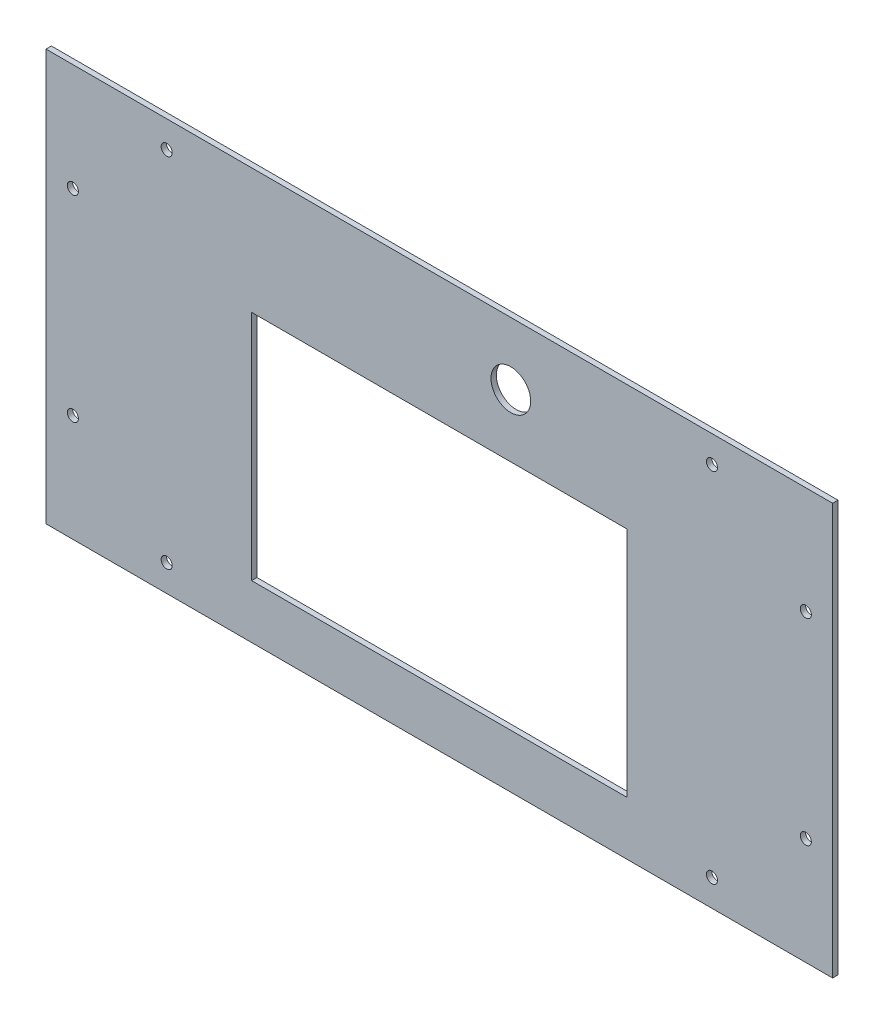
ISO-10303-21;
HEADER;
FILE_DESCRIPTION(('STEP AP214'),'2;1');
FILE_NAME('part.step','',(''),(''),'','','');
FILE_SCHEMA(('AUTOMOTIVE_DESIGN { 1 0 10303 214 1 1 1 1 }'));
ENDSEC;
DATA;
#1=APPLICATION_CONTEXT('core data for automotive mechanical design processes');
#2=APPLICATION_PROTOCOL_DEFINITION('international standard','automotive_design',2000,#1);
#3=PRODUCT_CONTEXT('',#1,'mechanical');
#4=PRODUCT('Part','Part','',(#3));
#5=PRODUCT_RELATED_PRODUCT_CATEGORY('part','',(#4));
#6=PRODUCT_DEFINITION_FORMATION('','',#4);
#7=PRODUCT_DEFINITION_CONTEXT('part definition',#1,'design');
#8=PRODUCT_DEFINITION('design','',#6,#7);
#9=PRODUCT_DEFINITION_SHAPE('','',#8);
#10=(LENGTH_UNIT() NAMED_UNIT(*) SI_UNIT(.MILLI.,.METRE.));
#11=(NAMED_UNIT(*) PLANE_ANGLE_UNIT() SI_UNIT($,.RADIAN.));
#12=(NAMED_UNIT(*) SI_UNIT($,.STERADIAN.) SOLID_ANGLE_UNIT());
#13=UNCERTAINTY_MEASURE_WITH_UNIT(LENGTH_MEASURE(1.E-05),#10,'distance_accuracy_value','');
#14=(GEOMETRIC_REPRESENTATION_CONTEXT(3) GLOBAL_UNCERTAINTY_ASSIGNED_CONTEXT((#13)) GLOBAL_UNIT_ASSIGNED_CONTEXT((#10,
#11,#12)) REPRESENTATION_CONTEXT('',''));
#15=CARTESIAN_POINT('',(0.,0.,0.));
#16=DIRECTION('',(0.,0.,1.));
#17=DIRECTION('',(1.,0.,0.));
#18=AXIS2_PLACEMENT_3D('',#15,#16,#17);
#19=CARTESIAN_POINT('',(220.,115.,3.));
#20=DIRECTION('',(-1.,0.,0.));
#21=DIRECTION('',(0.,0.,1.));
#22=AXIS2_PLACEMENT_3D('',#19,#20,#21);
#23=PLANE('',#22);
#24=DIRECTION('',(0.,1.,0.));
#25=VECTOR('',#24,1.);
#26=CARTESIAN_POINT('',(220.,115.,0.));
#27=LINE('',#26,#25);
#28=CARTESIAN_POINT('',(220.,-115.,0.));
#29=VERTEX_POINT('',#28);
#30=CARTESIAN_POINT('',(220.,115.,0.));
#31=VERTEX_POINT('',#30);
#32=EDGE_CURVE('E183',#29,#31,#27,.T.);
#33=ORIENTED_EDGE('',*,*,#32,.T.);
#34=DIRECTION('',(0.,0.,-1.));
#35=VECTOR('',#34,1.);
#36=CARTESIAN_POINT('',(220.,115.,3.));
#37=LINE('',#36,#35);
#38=CARTESIAN_POINT('',(220.,115.,3.));
#39=VERTEX_POINT('',#38);
#40=EDGE_CURVE('E11',#39,#31,#37,.T.);
#41=ORIENTED_EDGE('',*,*,#40,.F.);
#42=DIRECTION('',(0.,1.,0.));
#43=VECTOR('',#42,1.);
#44=CARTESIAN_POINT('',(220.,115.,3.));
#45=LINE('',#44,#43);
#46=CARTESIAN_POINT('',(220.,-115.,3.));
#47=VERTEX_POINT('',#46);
#48=EDGE_CURVE('E186',#47,#39,#45,.T.);
#49=ORIENTED_EDGE('',*,*,#48,.F.);
#50=DIRECTION('',(0.,0.,-1.));
#51=VECTOR('',#50,1.);
#52=CARTESIAN_POINT('',(220.,-115.,3.));
#53=LINE('',#52,#51);
#54=EDGE_CURVE('E196',#47,#29,#53,.T.);
#55=ORIENTED_EDGE('',*,*,#54,.T.);
#56=EDGE_LOOP('',(#33,#41,#49,#55));
#57=FACE_BOUND('',#56,.T.);
#58=ADVANCED_FACE('F33',(#57),#23,.F.);
#59=CARTESIAN_POINT('',(-220.,115.,3.));
#60=DIRECTION('',(0.,-1.,0.));
#61=DIRECTION('',(0.,0.,-1.));
#62=AXIS2_PLACEMENT_3D('',#59,#60,#61);
#63=PLANE('',#62);
#64=DIRECTION('',(-1.,0.,0.));
#65=VECTOR('',#64,1.);
#66=CARTESIAN_POINT('',(-220.,115.,0.));
#67=LINE('',#66,#65);
#68=CARTESIAN_POINT('',(-220.,115.,0.));
#69=VERTEX_POINT('',#68);
#70=EDGE_CURVE('E199',#31,#69,#67,.T.);
#71=ORIENTED_EDGE('',*,*,#70,.T.);
#72=DIRECTION('',(0.,0.,-1.));
#73=VECTOR('',#72,1.);
#74=CARTESIAN_POINT('',(-220.,115.,3.));
#75=LINE('',#74,#73);
#76=CARTESIAN_POINT('',(-220.,115.,3.));
#77=VERTEX_POINT('',#76);
#78=EDGE_CURVE('E40',#77,#69,#75,.T.);
#79=ORIENTED_EDGE('',*,*,#78,.F.);
#80=DIRECTION('',(-1.,0.,0.));
#81=VECTOR('',#80,1.);
#82=CARTESIAN_POINT('',(-220.,115.,3.));
#83=LINE('',#82,#81);
#84=EDGE_CURVE('E189',#39,#77,#83,.T.);
#85=ORIENTED_EDGE('',*,*,#84,.F.);
#86=ORIENTED_EDGE('',*,*,#40,.T.);
#87=EDGE_LOOP('',(#71,#79,#85,#86));
#88=FACE_BOUND('',#87,.T.);
#89=ADVANCED_FACE('F228',(#88),#63,.F.);
#90=CARTESIAN_POINT('',(-220.,115.,3.));
#91=DIRECTION('',(1.,0.,0.));
#92=DIRECTION('',(0.,1.,0.));
#93=AXIS2_PLACEMENT_3D('',#90,#91,#92);
#94=PLANE('',#93);
#95=DIRECTION('',(0.,-1.,0.));
#96=VECTOR('',#95,1.);
#97=CARTESIAN_POINT('',(-220.,115.,0.));
#98=LINE('',#97,#96);
#99=CARTESIAN_POINT('',(-220.,-115.,0.));
#100=VERTEX_POINT('',#99);
#101=EDGE_CURVE('E201',#69,#100,#98,.T.);
#102=ORIENTED_EDGE('',*,*,#101,.T.);
#103=DIRECTION('',(0.,0.,-1.));
#104=VECTOR('',#103,1.);
#105=CARTESIAN_POINT('',(-220.,-115.,3.));
#106=LINE('',#105,#104);
#107=CARTESIAN_POINT('',(-220.,-115.,3.));
#108=VERTEX_POINT('',#107);
#109=EDGE_CURVE('E206',#108,#100,#106,.T.);
#110=ORIENTED_EDGE('',*,*,#109,.F.);
#111=DIRECTION('',(0.,-1.,0.));
#112=VECTOR('',#111,1.);
#113=CARTESIAN_POINT('',(-220.,115.,3.));
#114=LINE('',#113,#112);
#115=EDGE_CURVE('E192',#77,#108,#114,.T.);
#116=ORIENTED_EDGE('',*,*,#115,.F.);
#117=ORIENTED_EDGE('',*,*,#78,.T.);
#118=EDGE_LOOP('',(#102,#110,#116,#117));
#119=FACE_BOUND('',#118,.T.);
#120=ADVANCED_FACE('F213',(#119),#94,.F.);
#121=CARTESIAN_POINT('',(-220.,-115.,3.));
#122=DIRECTION('',(0.,1.,0.));
#123=DIRECTION('',(0.,0.,1.));
#124=AXIS2_PLACEMENT_3D('',#121,#122,#123);
#125=PLANE('',#124);
#126=DIRECTION('',(1.,0.,0.));
#127=VECTOR('',#126,1.);
#128=CARTESIAN_POINT('',(-220.,-115.,0.));
#129=LINE('',#128,#127);
#130=EDGE_CURVE('E190',#100,#29,#129,.T.);
#131=ORIENTED_EDGE('',*,*,#130,.T.);
#132=ORIENTED_EDGE('',*,*,#54,.F.);
#133=DIRECTION('',(1.,0.,0.));
#134=VECTOR('',#133,1.);
#135=CARTESIAN_POINT('',(-220.,-115.,3.));
#136=LINE('',#135,#134);
#137=EDGE_CURVE('E194',#108,#47,#136,.T.);
#138=ORIENTED_EDGE('',*,*,#137,.F.);
#139=ORIENTED_EDGE('',*,*,#109,.T.);
#140=EDGE_LOOP('',(#131,#132,#138,#139));
#141=FACE_BOUND('',#140,.T.);
#142=ADVANCED_FACE('F222',(#141),#125,.F.);
#143=CARTESIAN_POINT('',(0.,0.,3.));
#144=DIRECTION('',(0.,0.,1.));
#145=DIRECTION('',(1.,0.,0.));
#146=AXIS2_PLACEMENT_3D('',#143,#144,#145);
#147=PLANE('',#146);
#148=CARTESIAN_POINT('',(40.,80.,3.));
#149=DIRECTION('',(0.,0.,-1.));
#150=DIRECTION('',(-1.,0.,0.));
#151=AXIS2_PLACEMENT_3D('',#148,#149,#150);
#152=CIRCLE('',#151,11.1);
#153=CARTESIAN_POINT('',(28.9,80.,3.));
#154=VERTEX_POINT('',#153);
#155=EDGE_CURVE('E128',#154,#154,#152,.T.);
#156=ORIENTED_EDGE('',*,*,#155,.T.);
#157=EDGE_LOOP('',(#156));
#158=FACE_BOUND('',#157,.T.);
#159=DIRECTION('',(0.,1.,0.));
#160=VECTOR('',#159,1.);
#161=CARTESIAN_POINT('',(-105.,45.,3.));
#162=LINE('',#161,#160);
#163=CARTESIAN_POINT('',(-105.,-85.,3.));
#164=VERTEX_POINT('',#163);
#165=CARTESIAN_POINT('',(-105.,45.,3.));
#166=VERTEX_POINT('',#165);
#167=EDGE_CURVE('E99',#164,#166,#162,.T.);
#168=ORIENTED_EDGE('',*,*,#167,.T.);
#169=DIRECTION('',(1.,0.,0.));
#170=VECTOR('',#169,1.);
#171=CARTESIAN_POINT('',(105.,45.,3.));
#172=LINE('',#171,#170);
#173=CARTESIAN_POINT('',(105.,45.,3.));
#174=VERTEX_POINT('',#173);
#175=EDGE_CURVE('E108',#166,#174,#172,.T.);
#176=ORIENTED_EDGE('',*,*,#175,.T.);
#177=DIRECTION('',(0.,-1.,0.));
#178=VECTOR('',#177,1.);
#179=CARTESIAN_POINT('',(105.,45.,3.));
#180=LINE('',#179,#178);
#181=CARTESIAN_POINT('',(105.,-85.,3.));
#182=VERTEX_POINT('',#181);
#183=EDGE_CURVE('E47',#174,#182,#180,.T.);
#184=ORIENTED_EDGE('',*,*,#183,.T.);
#185=DIRECTION('',(-1.,0.,0.));
#186=VECTOR('',#185,1.);
#187=CARTESIAN_POINT('',(105.,-85.,3.));
#188=LINE('',#187,#186);
#189=EDGE_CURVE('E105',#182,#164,#188,.T.);
#190=ORIENTED_EDGE('',*,*,#189,.T.);
#191=EDGE_LOOP('',(#168,#176,#184,#190));
#192=FACE_BOUND('',#191,.T.);
#193=CARTESIAN_POINT('',(-152.5,100.,3.));
#194=DIRECTION('',(0.,0.,1.));
#195=DIRECTION('',(1.,0.,0.));
#196=AXIS2_PLACEMENT_3D('',#193,#194,#195);
#197=CIRCLE('',#196,3.09999999999999);
#198=CARTESIAN_POINT('',(-149.4,100.,3.));
#199=VERTEX_POINT('',#198);
#200=EDGE_CURVE('E160',#199,#199,#197,.T.);
#201=ORIENTED_EDGE('',*,*,#200,.F.);
#202=EDGE_LOOP('',(#201));
#203=FACE_BOUND('',#202,.T.);
#204=CARTESIAN_POINT('',(152.5,100.,3.));
#205=DIRECTION('',(0.,0.,1.));
#206=DIRECTION('',(-1.,0.,0.));
#207=AXIS2_PLACEMENT_3D('',#204,#205,#206);
#208=CIRCLE('',#207,3.09999999999999);
#209=CARTESIAN_POINT('',(149.4,100.,3.));
#210=VERTEX_POINT('',#209);
#211=EDGE_CURVE('E166',#210,#210,#208,.T.);
#212=ORIENTED_EDGE('',*,*,#211,.F.);
#213=EDGE_LOOP('',(#212));
#214=FACE_BOUND('',#213,.T.);
#215=CARTESIAN_POINT('',(-205.,-55.0000000000368,3.));
#216=DIRECTION('',(0.,0.,1.));
#217=DIRECTION('',(-1.,0.,0.));
#218=AXIS2_PLACEMENT_3D('',#215,#216,#217);
#219=CIRCLE('',#218,3.09999999999999);
#220=CARTESIAN_POINT('',(-208.1,-55.0000000000368,3.));
#221=VERTEX_POINT('',#220);
#222=EDGE_CURVE('E172',#221,#221,#219,.T.);
#223=ORIENTED_EDGE('',*,*,#222,.F.);
#224=EDGE_LOOP('',(#223));
#225=FACE_BOUND('',#224,.T.);
#226=CARTESIAN_POINT('',(205.,-55.0000000000368,3.));
#227=DIRECTION('',(0.,0.,1.));
#228=DIRECTION('',(1.,0.,0.));
#229=AXIS2_PLACEMENT_3D('',#226,#227,#228);
#230=CIRCLE('',#229,3.09999999999999);
#231=CARTESIAN_POINT('',(208.1,-55.0000000000368,3.));
#232=VERTEX_POINT('',#231);
#233=EDGE_CURVE('E141',#232,#232,#230,.T.);
#234=ORIENTED_EDGE('',*,*,#233,.F.);
#235=EDGE_LOOP('',(#234));
#236=FACE_BOUND('',#235,.T.);
#237=CARTESIAN_POINT('',(205.,54.9999999999632,3.));
#238=DIRECTION('',(0.,0.,1.));
#239=DIRECTION('',(-1.,0.,0.));
#240=AXIS2_PLACEMENT_3D('',#237,#238,#239);
#241=CIRCLE('',#240,3.09999999999999);
#242=CARTESIAN_POINT('',(201.9,54.9999999999632,3.));
#243=VERTEX_POINT('',#242);
#244=EDGE_CURVE('E142',#243,#243,#241,.T.);
#245=ORIENTED_EDGE('',*,*,#244,.F.);
#246=EDGE_LOOP('',(#245));
#247=FACE_BOUND('',#246,.T.);
#248=CARTESIAN_POINT('',(152.5,-100.000000000073,3.));
#249=DIRECTION('',(0.,0.,1.));
#250=DIRECTION('',(1.,0.,0.));
#251=AXIS2_PLACEMENT_3D('',#248,#249,#250);
#252=CIRCLE('',#251,3.09999999999999);
#253=CARTESIAN_POINT('',(155.6,-100.000000000073,3.));
#254=VERTEX_POINT('',#253);
#255=EDGE_CURVE('E148',#254,#254,#252,.T.);
#256=ORIENTED_EDGE('',*,*,#255,.F.);
#257=EDGE_LOOP('',(#256));
#258=FACE_BOUND('',#257,.T.);
#259=CARTESIAN_POINT('',(-152.5,-100.000000000074,3.));
#260=DIRECTION('',(0.,0.,1.));
#261=DIRECTION('',(-1.,0.,0.));
#262=AXIS2_PLACEMENT_3D('',#259,#260,#261);
#263=CIRCLE('',#262,3.09999999999999);
#264=CARTESIAN_POINT('',(-155.6,-100.000000000074,3.));
#265=VERTEX_POINT('',#264);
#266=EDGE_CURVE('E134',#265,#265,#263,.T.);
#267=ORIENTED_EDGE('',*,*,#266,.F.);
#268=EDGE_LOOP('',(#267));
#269=FACE_BOUND('',#268,.T.);
#270=CARTESIAN_POINT('',(-205.,54.9999999999632,3.));
#271=DIRECTION('',(0.,0.,1.));
#272=DIRECTION('',(1.,0.,0.));
#273=AXIS2_PLACEMENT_3D('',#270,#271,#272);
#274=CIRCLE('',#273,3.09999999999999);
#275=CARTESIAN_POINT('',(-201.9,54.9999999999632,3.));
#276=VERTEX_POINT('',#275);
#277=EDGE_CURVE('E159',#276,#276,#274,.T.);
#278=ORIENTED_EDGE('',*,*,#277,.F.);
#279=EDGE_LOOP('',(#278));
#280=FACE_BOUND('',#279,.T.);
#281=ORIENTED_EDGE('',*,*,#48,.T.);
#282=ORIENTED_EDGE('',*,*,#84,.T.);
#283=ORIENTED_EDGE('',*,*,#115,.T.);
#284=ORIENTED_EDGE('',*,*,#137,.T.);
#285=EDGE_LOOP('',(#281,#282,#283,#284));
#286=FACE_BOUND('',#285,.T.);
#287=ADVANCED_FACE('F112',(#158,#192,#203,#214,#225,#236,#247,#258,#269,#280,#286),#147,.T.);
#288=CARTESIAN_POINT('',(0.,0.,0.));
#289=DIRECTION('',(0.,0.,1.));
#290=DIRECTION('',(1.,0.,0.));
#291=AXIS2_PLACEMENT_3D('',#288,#289,#290);
#292=PLANE('',#291);
#293=CARTESIAN_POINT('',(40.,80.,0.));
#294=DIRECTION('',(0.,0.,-1.));
#295=DIRECTION('',(-1.,0.,0.));
#296=AXIS2_PLACEMENT_3D('',#293,#294,#295);
#297=CIRCLE('',#296,11.1);
#298=CARTESIAN_POINT('',(28.9,80.,0.));
#299=VERTEX_POINT('',#298);
#300=EDGE_CURVE('E121',#299,#299,#297,.T.);
#301=ORIENTED_EDGE('',*,*,#300,.F.);
#302=EDGE_LOOP('',(#301));
#303=FACE_BOUND('',#302,.T.);
#304=DIRECTION('',(1.,0.,0.));
#305=VECTOR('',#304,1.);
#306=CARTESIAN_POINT('',(105.,45.,0.));
#307=LINE('',#306,#305);
#308=CARTESIAN_POINT('',(-105.,45.,0.));
#309=VERTEX_POINT('',#308);
#310=CARTESIAN_POINT('',(105.,45.,0.));
#311=VERTEX_POINT('',#310);
#312=EDGE_CURVE('E127',#309,#311,#307,.T.);
#313=ORIENTED_EDGE('',*,*,#312,.F.);
#314=DIRECTION('',(0.,1.,0.));
#315=VECTOR('',#314,1.);
#316=CARTESIAN_POINT('',(-105.,45.,0.));
#317=LINE('',#316,#315);
#318=CARTESIAN_POINT('',(-105.,-85.,0.));
#319=VERTEX_POINT('',#318);
#320=EDGE_CURVE('E55',#319,#309,#317,.T.);
#321=ORIENTED_EDGE('',*,*,#320,.F.);
#322=DIRECTION('',(-1.,0.,0.));
#323=VECTOR('',#322,1.);
#324=CARTESIAN_POINT('',(105.,-85.,0.));
#325=LINE('',#324,#323);
#326=CARTESIAN_POINT('',(105.,-85.,0.));
#327=VERTEX_POINT('',#326);
#328=EDGE_CURVE('E115',#327,#319,#325,.T.);
#329=ORIENTED_EDGE('',*,*,#328,.F.);
#330=DIRECTION('',(0.,-1.,0.));
#331=VECTOR('',#330,1.);
#332=CARTESIAN_POINT('',(105.,45.,0.));
#333=LINE('',#332,#331);
#334=EDGE_CURVE('E118',#311,#327,#333,.T.);
#335=ORIENTED_EDGE('',*,*,#334,.F.);
#336=EDGE_LOOP('',(#313,#321,#329,#335));
#337=FACE_BOUND('',#336,.T.);
#338=CARTESIAN_POINT('',(-152.5,100.,0.));
#339=DIRECTION('',(0.,0.,1.));
#340=DIRECTION('',(1.,0.,0.));
#341=AXIS2_PLACEMENT_3D('',#338,#339,#340);
#342=CIRCLE('',#341,3.09999999999999);
#343=CARTESIAN_POINT('',(-149.4,100.,0.));
#344=VERTEX_POINT('',#343);
#345=EDGE_CURVE('E156',#344,#344,#342,.T.);
#346=ORIENTED_EDGE('',*,*,#345,.T.);
#347=EDGE_LOOP('',(#346));
#348=FACE_BOUND('',#347,.T.);
#349=CARTESIAN_POINT('',(152.5,100.,0.));
#350=DIRECTION('',(0.,0.,1.));
#351=DIRECTION('',(-1.,0.,0.));
#352=AXIS2_PLACEMENT_3D('',#349,#350,#351);
#353=CIRCLE('',#352,3.09999999999999);
#354=CARTESIAN_POINT('',(149.4,100.,0.));
#355=VERTEX_POINT('',#354);
#356=EDGE_CURVE('E163',#355,#355,#353,.T.);
#357=ORIENTED_EDGE('',*,*,#356,.T.);
#358=EDGE_LOOP('',(#357));
#359=FACE_BOUND('',#358,.T.);
#360=CARTESIAN_POINT('',(-205.,-55.0000000000368,0.));
#361=DIRECTION('',(0.,0.,1.));
#362=DIRECTION('',(-1.,0.,0.));
#363=AXIS2_PLACEMENT_3D('',#360,#361,#362);
#364=CIRCLE('',#363,3.09999999999999);
#365=CARTESIAN_POINT('',(-208.1,-55.0000000000368,0.));
#366=VERTEX_POINT('',#365);
#367=EDGE_CURVE('E169',#366,#366,#364,.T.);
#368=ORIENTED_EDGE('',*,*,#367,.T.);
#369=EDGE_LOOP('',(#368));
#370=FACE_BOUND('',#369,.T.);
#371=CARTESIAN_POINT('',(205.,-55.0000000000368,0.));
#372=DIRECTION('',(0.,0.,1.));
#373=DIRECTION('',(1.,0.,0.));
#374=AXIS2_PLACEMENT_3D('',#371,#372,#373);
#375=CIRCLE('',#374,3.09999999999999);
#376=CARTESIAN_POINT('',(208.1,-55.0000000000368,0.));
#377=VERTEX_POINT('',#376);
#378=EDGE_CURVE('E175',#377,#377,#375,.T.);
#379=ORIENTED_EDGE('',*,*,#378,.T.);
#380=EDGE_LOOP('',(#379));
#381=FACE_BOUND('',#380,.T.);
#382=CARTESIAN_POINT('',(205.,54.9999999999632,0.));
#383=DIRECTION('',(0.,0.,1.));
#384=DIRECTION('',(-1.,0.,0.));
#385=AXIS2_PLACEMENT_3D('',#382,#383,#384);
#386=CIRCLE('',#385,3.09999999999999);
#387=CARTESIAN_POINT('',(201.9,54.9999999999632,0.));
#388=VERTEX_POINT('',#387);
#389=EDGE_CURVE('E138',#388,#388,#386,.T.);
#390=ORIENTED_EDGE('',*,*,#389,.T.);
#391=EDGE_LOOP('',(#390));
#392=FACE_BOUND('',#391,.T.);
#393=CARTESIAN_POINT('',(152.5,-100.000000000073,0.));
#394=DIRECTION('',(0.,0.,1.));
#395=DIRECTION('',(1.,0.,0.));
#396=AXIS2_PLACEMENT_3D('',#393,#394,#395);
#397=CIRCLE('',#396,3.09999999999999);
#398=CARTESIAN_POINT('',(155.6,-100.000000000073,0.));
#399=VERTEX_POINT('',#398);
#400=EDGE_CURVE('E145',#399,#399,#397,.T.);
#401=ORIENTED_EDGE('',*,*,#400,.T.);
#402=EDGE_LOOP('',(#401));
#403=FACE_BOUND('',#402,.T.);
#404=CARTESIAN_POINT('',(-152.5,-100.000000000074,0.));
#405=DIRECTION('',(0.,0.,1.));
#406=DIRECTION('',(-1.,0.,0.));
#407=AXIS2_PLACEMENT_3D('',#404,#405,#406);
#408=CIRCLE('',#407,3.09999999999999);
#409=CARTESIAN_POINT('',(-155.6,-100.000000000074,0.));
#410=VERTEX_POINT('',#409);
#411=EDGE_CURVE('E151',#410,#410,#408,.T.);
#412=ORIENTED_EDGE('',*,*,#411,.T.);
#413=EDGE_LOOP('',(#412));
#414=FACE_BOUND('',#413,.T.);
#415=CARTESIAN_POINT('',(-205.,54.9999999999632,0.));
#416=DIRECTION('',(0.,0.,1.));
#417=DIRECTION('',(1.,0.,0.));
#418=AXIS2_PLACEMENT_3D('',#415,#416,#417);
#419=CIRCLE('',#418,3.09999999999999);
#420=CARTESIAN_POINT('',(-201.9,54.9999999999632,0.));
#421=VERTEX_POINT('',#420);
#422=EDGE_CURVE('E180',#421,#421,#419,.T.);
#423=ORIENTED_EDGE('',*,*,#422,.T.);
#424=EDGE_LOOP('',(#423));
#425=FACE_BOUND('',#424,.T.);
#426=ORIENTED_EDGE('',*,*,#32,.F.);
#427=ORIENTED_EDGE('',*,*,#130,.F.);
#428=ORIENTED_EDGE('',*,*,#101,.F.);
#429=ORIENTED_EDGE('',*,*,#70,.F.);
#430=EDGE_LOOP('',(#426,#427,#428,#429));
#431=FACE_BOUND('',#430,.T.);
#432=ADVANCED_FACE('F219',(#303,#337,#348,#359,#370,#381,#392,#403,#414,#425,#431),#292,.F.);
#433=CARTESIAN_POINT('',(-205.,54.9999999999632,0.));
#434=DIRECTION('',(0.,0.,1.));
#435=DIRECTION('',(1.,0.,0.));
#436=AXIS2_PLACEMENT_3D('',#433,#434,#435);
#437=CYLINDRICAL_SURFACE('',#436,3.09999999999999);
#438=ORIENTED_EDGE('',*,*,#422,.F.);
#439=EDGE_LOOP('',(#438));
#440=FACE_BOUND('',#439,.T.);
#441=ORIENTED_EDGE('',*,*,#277,.T.);
#442=EDGE_LOOP('',(#441));
#443=FACE_BOUND('',#442,.T.);
#444=ADVANCED_FACE('F240',(#440,#443),#437,.F.);
#445=CARTESIAN_POINT('',(-152.5,-100.000000000074,0.));
#446=DIRECTION('',(0.,0.,1.));
#447=DIRECTION('',(1.,0.,0.));
#448=AXIS2_PLACEMENT_3D('',#445,#446,#447);
#449=CYLINDRICAL_SURFACE('',#448,3.09999999999999);
#450=ORIENTED_EDGE('',*,*,#411,.F.);
#451=EDGE_LOOP('',(#450));
#452=FACE_BOUND('',#451,.T.);
#453=ORIENTED_EDGE('',*,*,#266,.T.);
#454=EDGE_LOOP('',(#453));
#455=FACE_BOUND('',#454,.T.);
#456=ADVANCED_FACE('F247',(#452,#455),#449,.F.);
#457=CARTESIAN_POINT('',(152.5,-100.000000000073,0.));
#458=DIRECTION('',(0.,0.,1.));
#459=DIRECTION('',(1.,0.,0.));
#460=AXIS2_PLACEMENT_3D('',#457,#458,#459);
#461=CYLINDRICAL_SURFACE('',#460,3.09999999999999);
#462=ORIENTED_EDGE('',*,*,#400,.F.);
#463=EDGE_LOOP('',(#462));
#464=FACE_BOUND('',#463,.T.);
#465=ORIENTED_EDGE('',*,*,#255,.T.);
#466=EDGE_LOOP('',(#465));
#467=FACE_BOUND('',#466,.T.);
#468=ADVANCED_FACE('F268',(#464,#467),#461,.F.);
#469=CARTESIAN_POINT('',(205.,54.9999999999632,0.));
#470=DIRECTION('',(0.,0.,1.));
#471=DIRECTION('',(1.,0.,0.));
#472=AXIS2_PLACEMENT_3D('',#469,#470,#471);
#473=CYLINDRICAL_SURFACE('',#472,3.09999999999999);
#474=ORIENTED_EDGE('',*,*,#389,.F.);
#475=EDGE_LOOP('',(#474));
#476=FACE_BOUND('',#475,.T.);
#477=ORIENTED_EDGE('',*,*,#244,.T.);
#478=EDGE_LOOP('',(#477));
#479=FACE_BOUND('',#478,.T.);
#480=ADVANCED_FACE('F253',(#476,#479),#473,.F.);
#481=CARTESIAN_POINT('',(205.,-55.0000000000368,0.));
#482=DIRECTION('',(0.,0.,1.));
#483=DIRECTION('',(1.,0.,0.));
#484=AXIS2_PLACEMENT_3D('',#481,#482,#483);
#485=CYLINDRICAL_SURFACE('',#484,3.09999999999999);
#486=ORIENTED_EDGE('',*,*,#378,.F.);
#487=EDGE_LOOP('',(#486));
#488=FACE_BOUND('',#487,.T.);
#489=ORIENTED_EDGE('',*,*,#233,.T.);
#490=EDGE_LOOP('',(#489));
#491=FACE_BOUND('',#490,.T.);
#492=ADVANCED_FACE('F249',(#488,#491),#485,.F.);
#493=CARTESIAN_POINT('',(-205.,-55.0000000000368,0.));
#494=DIRECTION('',(0.,0.,1.));
#495=DIRECTION('',(1.,0.,0.));
#496=AXIS2_PLACEMENT_3D('',#493,#494,#495);
#497=CYLINDRICAL_SURFACE('',#496,3.09999999999999);
#498=ORIENTED_EDGE('',*,*,#367,.F.);
#499=EDGE_LOOP('',(#498));
#500=FACE_BOUND('',#499,.T.);
#501=ORIENTED_EDGE('',*,*,#222,.T.);
#502=EDGE_LOOP('',(#501));
#503=FACE_BOUND('',#502,.T.);
#504=ADVANCED_FACE('F252',(#500,#503),#497,.F.);
#505=CARTESIAN_POINT('',(152.5,100.,0.));
#506=DIRECTION('',(0.,0.,1.));
#507=DIRECTION('',(1.,0.,0.));
#508=AXIS2_PLACEMENT_3D('',#505,#506,#507);
#509=CYLINDRICAL_SURFACE('',#508,3.09999999999999);
#510=ORIENTED_EDGE('',*,*,#356,.F.);
#511=EDGE_LOOP('',(#510));
#512=FACE_BOUND('',#511,.T.);
#513=ORIENTED_EDGE('',*,*,#211,.T.);
#514=EDGE_LOOP('',(#513));
#515=FACE_BOUND('',#514,.T.);
#516=ADVANCED_FACE('F257',(#512,#515),#509,.F.);
#517=CARTESIAN_POINT('',(-152.5,100.,0.));
#518=DIRECTION('',(0.,0.,1.));
#519=DIRECTION('',(1.,0.,0.));
#520=AXIS2_PLACEMENT_3D('',#517,#518,#519);
#521=CYLINDRICAL_SURFACE('',#520,3.09999999999999);
#522=ORIENTED_EDGE('',*,*,#345,.F.);
#523=EDGE_LOOP('',(#522));
#524=FACE_BOUND('',#523,.T.);
#525=ORIENTED_EDGE('',*,*,#200,.T.);
#526=EDGE_LOOP('',(#525));
#527=FACE_BOUND('',#526,.T.);
#528=ADVANCED_FACE('F261',(#524,#527),#521,.F.);
#529=CARTESIAN_POINT('',(-105.,45.,3.));
#530=DIRECTION('',(-1.,0.,0.));
#531=DIRECTION('',(0.,-1.,0.));
#532=AXIS2_PLACEMENT_3D('',#529,#530,#531);
#533=PLANE('',#532);
#534=ORIENTED_EDGE('',*,*,#320,.T.);
#535=DIRECTION('',(0.,0.,-1.));
#536=VECTOR('',#535,1.);
#537=CARTESIAN_POINT('',(-105.,45.,3.));
#538=LINE('',#537,#536);
#539=EDGE_CURVE('E95',#166,#309,#538,.T.);
#540=ORIENTED_EDGE('',*,*,#539,.F.);
#541=ORIENTED_EDGE('',*,*,#167,.F.);
#542=DIRECTION('',(0.,0.,-1.));
#543=VECTOR('',#542,1.);
#544=CARTESIAN_POINT('',(-105.,-85.,3.));
#545=LINE('',#544,#543);
#546=EDGE_CURVE('E132',#164,#319,#545,.T.);
#547=ORIENTED_EDGE('',*,*,#546,.T.);
#548=EDGE_LOOP('',(#534,#540,#541,#547));
#549=FACE_BOUND('',#548,.T.);
#550=ADVANCED_FACE('F97',(#549),#533,.F.);
#551=CARTESIAN_POINT('',(105.,-85.,3.));
#552=DIRECTION('',(0.,-1.,0.));
#553=DIRECTION('',(0.,0.,-1.));
#554=AXIS2_PLACEMENT_3D('',#551,#552,#553);
#555=PLANE('',#554);
#556=ORIENTED_EDGE('',*,*,#328,.T.);
#557=ORIENTED_EDGE('',*,*,#546,.F.);
#558=ORIENTED_EDGE('',*,*,#189,.F.);
#559=DIRECTION('',(0.,0.,-1.));
#560=VECTOR('',#559,1.);
#561=CARTESIAN_POINT('',(105.,-85.,3.));
#562=LINE('',#561,#560);
#563=EDGE_CURVE('E135',#182,#327,#562,.T.);
#564=ORIENTED_EDGE('',*,*,#563,.T.);
#565=EDGE_LOOP('',(#556,#557,#558,#564));
#566=FACE_BOUND('',#565,.T.);
#567=ADVANCED_FACE('F278',(#566),#555,.F.);
#568=CARTESIAN_POINT('',(105.,45.,3.));
#569=DIRECTION('',(1.,0.,0.));
#570=DIRECTION('',(0.,1.,0.));
#571=AXIS2_PLACEMENT_3D('',#568,#569,#570);
#572=PLANE('',#571);
#573=ORIENTED_EDGE('',*,*,#334,.T.);
#574=ORIENTED_EDGE('',*,*,#563,.F.);
#575=ORIENTED_EDGE('',*,*,#183,.F.);
#576=DIRECTION('',(0.,0.,-1.));
#577=VECTOR('',#576,1.);
#578=CARTESIAN_POINT('',(105.,45.,3.));
#579=LINE('',#578,#577);
#580=EDGE_CURVE('E104',#174,#311,#579,.T.);
#581=ORIENTED_EDGE('',*,*,#580,.T.);
#582=EDGE_LOOP('',(#573,#574,#575,#581));
#583=FACE_BOUND('',#582,.T.);
#584=ADVANCED_FACE('F282',(#583),#572,.F.);
#585=CARTESIAN_POINT('',(105.,45.,3.));
#586=DIRECTION('',(0.,1.,0.));
#587=DIRECTION('',(0.,0.,1.));
#588=AXIS2_PLACEMENT_3D('',#585,#586,#587);
#589=PLANE('',#588);
#590=ORIENTED_EDGE('',*,*,#312,.T.);
#591=ORIENTED_EDGE('',*,*,#580,.F.);
#592=ORIENTED_EDGE('',*,*,#175,.F.);
#593=ORIENTED_EDGE('',*,*,#539,.T.);
#594=EDGE_LOOP('',(#590,#591,#592,#593));
#595=FACE_BOUND('',#594,.T.);
#596=ADVANCED_FACE('F109',(#595),#589,.F.);
#597=CARTESIAN_POINT('',(40.,80.,3.));
#598=DIRECTION('',(0.,0.,-1.));
#599=DIRECTION('',(-1.,0.,0.));
#600=AXIS2_PLACEMENT_3D('',#597,#598,#599);
#601=CYLINDRICAL_SURFACE('',#600,11.1);
#602=ORIENTED_EDGE('',*,*,#155,.F.);
#603=EDGE_LOOP('',(#602));
#604=FACE_BOUND('',#603,.T.);
#605=ORIENTED_EDGE('',*,*,#300,.T.);
#606=EDGE_LOOP('',(#605));
#607=FACE_BOUND('',#606,.T.);
#608=ADVANCED_FACE('F281',(#604,#607),#601,.F.);
#609=CLOSED_SHELL('',(#58,#89,#120,#142,#287,#432,#444,#456,#468,#480,#492,#504,#516,#528,#550,
#567,#584,#596,#608));
#610=MANIFOLD_SOLID_BREP('B2',#609);
#611=ADVANCED_BREP_SHAPE_REPRESENTATION('',(#18,#610),#14);
#612=SHAPE_DEFINITION_REPRESENTATION(#9,#611);
ENDSEC;
END-ISO-10303-21;
